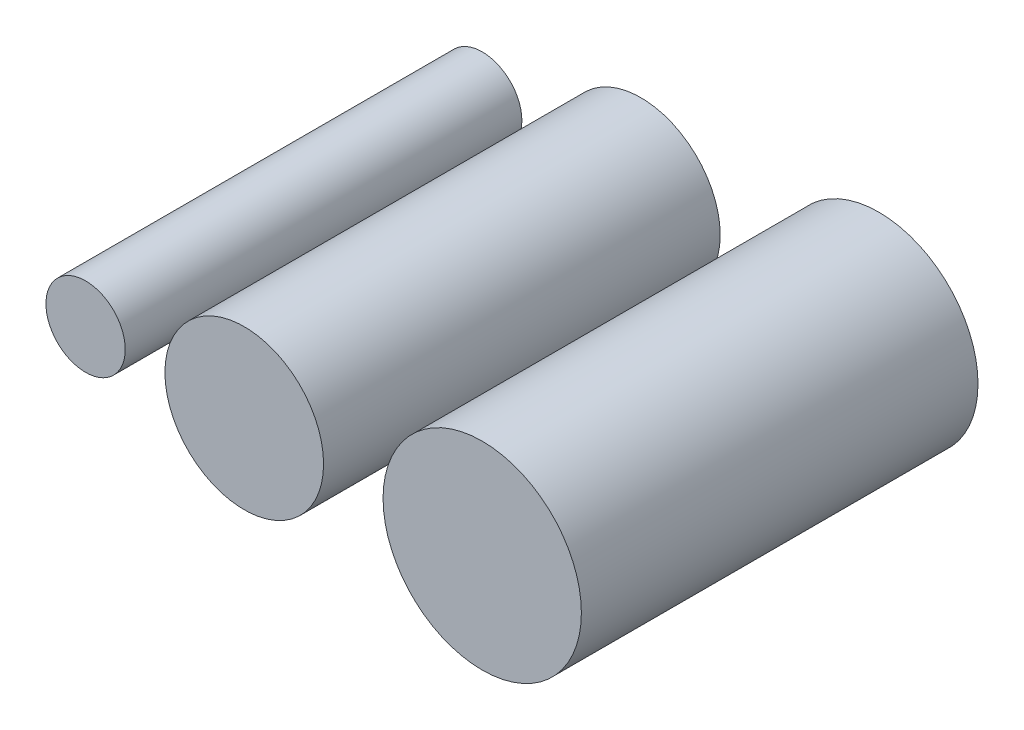
ISO-10303-21;
HEADER;
FILE_DESCRIPTION(('STEP AP214'),'2;1');
FILE_NAME('part.step','',(''),(''),'','','');
FILE_SCHEMA(('AUTOMOTIVE_DESIGN { 1 0 10303 214 1 1 1 1 }'));
ENDSEC;
DATA;
#1=APPLICATION_CONTEXT('core data for automotive mechanical design processes');
#2=APPLICATION_PROTOCOL_DEFINITION('international standard','automotive_design',2000,#1);
#3=PRODUCT_CONTEXT('',#1,'mechanical');
#4=PRODUCT('Part','Part','',(#3));
#5=PRODUCT_RELATED_PRODUCT_CATEGORY('part','',(#4));
#6=PRODUCT_DEFINITION_FORMATION('','',#4);
#7=PRODUCT_DEFINITION_CONTEXT('part definition',#1,'design');
#8=PRODUCT_DEFINITION('design','',#6,#7);
#9=PRODUCT_DEFINITION_SHAPE('','',#8);
#10=(LENGTH_UNIT() NAMED_UNIT(*) SI_UNIT(.MILLI.,.METRE.));
#11=(NAMED_UNIT(*) PLANE_ANGLE_UNIT() SI_UNIT($,.RADIAN.));
#12=(NAMED_UNIT(*) SI_UNIT($,.STERADIAN.) SOLID_ANGLE_UNIT());
#13=UNCERTAINTY_MEASURE_WITH_UNIT(LENGTH_MEASURE(1.E-05),#10,'distance_accuracy_value','');
#14=(GEOMETRIC_REPRESENTATION_CONTEXT(3) GLOBAL_UNCERTAINTY_ASSIGNED_CONTEXT((#13)) GLOBAL_UNIT_ASSIGNED_CONTEXT((#10,
#11,#12)) REPRESENTATION_CONTEXT('',''));
#15=CARTESIAN_POINT('',(0.,0.,0.));
#16=DIRECTION('',(0.,0.,1.));
#17=DIRECTION('',(1.,0.,0.));
#18=AXIS2_PLACEMENT_3D('',#15,#16,#17);
#19=CARTESIAN_POINT('',(5.,0.,5.));
#20=DIRECTION('',(0.,0.,-1.));
#21=DIRECTION('',(-1.,0.,0.));
#22=AXIS2_PLACEMENT_3D('',#19,#20,#21);
#23=CYLINDRICAL_SURFACE('',#22,1.25);
#24=CARTESIAN_POINT('',(5.,0.,5.));
#25=DIRECTION('',(0.,0.,1.));
#26=DIRECTION('',(1.,0.,0.));
#27=AXIS2_PLACEMENT_3D('',#24,#25,#26);
#28=CIRCLE('',#27,1.25);
#29=CARTESIAN_POINT('',(6.25,0.,5.));
#30=VERTEX_POINT('',#29);
#31=EDGE_CURVE('E56',#30,#30,#28,.T.);
#32=ORIENTED_EDGE('',*,*,#31,.F.);
#33=EDGE_LOOP('',(#32));
#34=FACE_BOUND('',#33,.T.);
#35=CARTESIAN_POINT('',(5.,0.,0.));
#36=DIRECTION('',(0.,0.,1.));
#37=DIRECTION('',(1.,0.,0.));
#38=AXIS2_PLACEMENT_3D('',#35,#36,#37);
#39=CIRCLE('',#38,1.25);
#40=CARTESIAN_POINT('',(6.25,0.,0.));
#41=VERTEX_POINT('',#40);
#42=EDGE_CURVE('E11',#41,#41,#39,.T.);
#43=ORIENTED_EDGE('',*,*,#42,.T.);
#44=EDGE_LOOP('',(#43));
#45=FACE_BOUND('',#44,.T.);
#46=ADVANCED_FACE('F52',(#34,#45),#23,.T.);
#47=CARTESIAN_POINT('',(5.,0.,5.));
#48=DIRECTION('',(0.,0.,1.));
#49=DIRECTION('',(1.,0.,0.));
#50=AXIS2_PLACEMENT_3D('',#47,#48,#49);
#51=PLANE('',#50);
#52=ORIENTED_EDGE('',*,*,#31,.T.);
#53=EDGE_LOOP('',(#52));
#54=FACE_BOUND('',#53,.T.);
#55=ADVANCED_FACE('F54',(#54),#51,.T.);
#56=CARTESIAN_POINT('',(5.,0.,0.));
#57=DIRECTION('',(0.,0.,1.));
#58=DIRECTION('',(1.,0.,0.));
#59=AXIS2_PLACEMENT_3D('',#56,#57,#58);
#60=PLANE('',#59);
#61=ORIENTED_EDGE('',*,*,#42,.F.);
#62=EDGE_LOOP('',(#61));
#63=FACE_BOUND('',#62,.T.);
#64=ADVANCED_FACE('F73',(#63),#60,.F.);
#65=CLOSED_SHELL('',(#46,#55,#64));
#66=MANIFOLD_SOLID_BREP('B2',#65);
#67=CARTESIAN_POINT('',(2.,0.,5.));
#68=DIRECTION('',(0.,0.,-1.));
#69=DIRECTION('',(-1.,0.,0.));
#70=AXIS2_PLACEMENT_3D('',#67,#68,#69);
#71=CYLINDRICAL_SURFACE('',#70,1.);
#72=CARTESIAN_POINT('',(2.,0.,5.));
#73=DIRECTION('',(0.,0.,1.));
#74=DIRECTION('',(1.,0.,0.));
#75=AXIS2_PLACEMENT_3D('',#72,#73,#74);
#76=CIRCLE('',#75,1.);
#77=CARTESIAN_POINT('',(3.,0.,5.));
#78=VERTEX_POINT('',#77);
#79=EDGE_CURVE('E106',#78,#78,#76,.T.);
#80=ORIENTED_EDGE('',*,*,#79,.F.);
#81=EDGE_LOOP('',(#80));
#82=FACE_BOUND('',#81,.T.);
#83=CARTESIAN_POINT('',(2.,0.,0.));
#84=DIRECTION('',(0.,0.,1.));
#85=DIRECTION('',(1.,0.,0.));
#86=AXIS2_PLACEMENT_3D('',#83,#84,#85);
#87=CIRCLE('',#86,1.);
#88=CARTESIAN_POINT('',(3.,0.,0.));
#89=VERTEX_POINT('',#88);
#90=EDGE_CURVE('E51',#89,#89,#87,.T.);
#91=ORIENTED_EDGE('',*,*,#90,.T.);
#92=EDGE_LOOP('',(#91));
#93=FACE_BOUND('',#92,.T.);
#94=ADVANCED_FACE('F102',(#82,#93),#71,.T.);
#95=CARTESIAN_POINT('',(2.,0.,5.));
#96=DIRECTION('',(0.,0.,1.));
#97=DIRECTION('',(1.,0.,0.));
#98=AXIS2_PLACEMENT_3D('',#95,#96,#97);
#99=PLANE('',#98);
#100=ORIENTED_EDGE('',*,*,#79,.T.);
#101=EDGE_LOOP('',(#100));
#102=FACE_BOUND('',#101,.T.);
#103=ADVANCED_FACE('F104',(#102),#99,.T.);
#104=CARTESIAN_POINT('',(2.,0.,0.));
#105=DIRECTION('',(0.,0.,1.));
#106=DIRECTION('',(1.,0.,0.));
#107=AXIS2_PLACEMENT_3D('',#104,#105,#106);
#108=PLANE('',#107);
#109=ORIENTED_EDGE('',*,*,#90,.F.);
#110=EDGE_LOOP('',(#109));
#111=FACE_BOUND('',#110,.T.);
#112=ADVANCED_FACE('F121',(#111),#108,.F.);
#113=CLOSED_SHELL('',(#94,#103,#112));
#114=MANIFOLD_SOLID_BREP('B6',#113);
#115=CARTESIAN_POINT('',(0.,0.,5.));
#116=DIRECTION('',(0.,0.,-1.));
#117=DIRECTION('',(-1.,0.,0.));
#118=AXIS2_PLACEMENT_3D('',#115,#116,#117);
#119=CYLINDRICAL_SURFACE('',#118,0.5);
#120=CARTESIAN_POINT('',(0.,0.,5.));
#121=DIRECTION('',(0.,0.,1.));
#122=DIRECTION('',(1.,0.,0.));
#123=AXIS2_PLACEMENT_3D('',#120,#121,#122);
#124=CIRCLE('',#123,0.5);
#125=CARTESIAN_POINT('',(0.5,0.,5.));
#126=VERTEX_POINT('',#125);
#127=EDGE_CURVE('E101',#126,#126,#124,.T.);
#128=ORIENTED_EDGE('',*,*,#127,.F.);
#129=EDGE_LOOP('',(#128));
#130=FACE_BOUND('',#129,.T.);
#131=CARTESIAN_POINT('',(0.,0.,0.));
#132=DIRECTION('',(0.,0.,1.));
#133=DIRECTION('',(1.,0.,0.));
#134=AXIS2_PLACEMENT_3D('',#131,#132,#133);
#135=CIRCLE('',#134,0.5);
#136=CARTESIAN_POINT('',(0.5,0.,0.));
#137=VERTEX_POINT('',#136);
#138=EDGE_CURVE('E146',#137,#137,#135,.T.);
#139=ORIENTED_EDGE('',*,*,#138,.T.);
#140=EDGE_LOOP('',(#139));
#141=FACE_BOUND('',#140,.T.);
#142=ADVANCED_FACE('F143',(#130,#141),#119,.T.);
#143=CARTESIAN_POINT('',(0.,0.,5.));
#144=DIRECTION('',(0.,0.,1.));
#145=DIRECTION('',(1.,0.,0.));
#146=AXIS2_PLACEMENT_3D('',#143,#144,#145);
#147=PLANE('',#146);
#148=ORIENTED_EDGE('',*,*,#127,.T.);
#149=EDGE_LOOP('',(#148));
#150=FACE_BOUND('',#149,.T.);
#151=ADVANCED_FACE('F158',(#150),#147,.T.);
#152=CARTESIAN_POINT('',(0.,0.,0.));
#153=DIRECTION('',(0.,0.,1.));
#154=DIRECTION('',(1.,0.,0.));
#155=AXIS2_PLACEMENT_3D('',#152,#153,#154);
#156=PLANE('',#155);
#157=ORIENTED_EDGE('',*,*,#138,.F.);
#158=EDGE_LOOP('',(#157));
#159=FACE_BOUND('',#158,.T.);
#160=ADVANCED_FACE('F156',(#159),#156,.F.);
#161=CLOSED_SHELL('',(#142,#151,#160));
#162=MANIFOLD_SOLID_BREP('B46',#161);
#163=ADVANCED_BREP_SHAPE_REPRESENTATION('',(#18,#66,#114,#162),#14);
#164=SHAPE_DEFINITION_REPRESENTATION(#9,#163);
ENDSEC;
END-ISO-10303-21;
